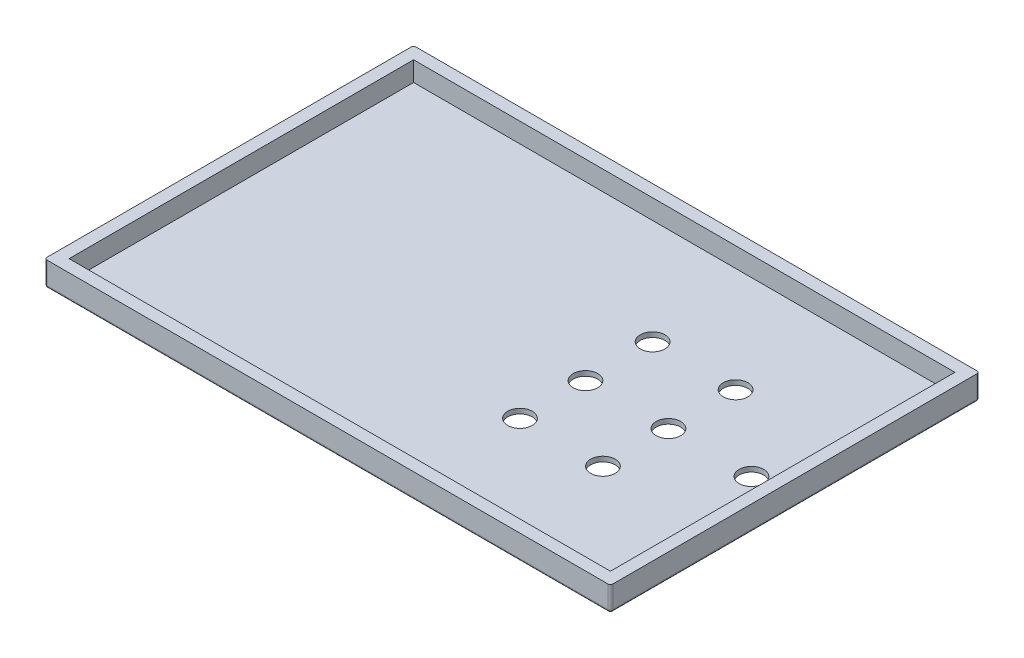
ISO-10303-21;
HEADER;
FILE_DESCRIPTION(('STEP AP214'),'2;1');
FILE_NAME('part.step','',(''),(''),'','','');
FILE_SCHEMA(('AUTOMOTIVE_DESIGN { 1 0 10303 214 1 1 1 1 }'));
ENDSEC;
DATA;
#1=APPLICATION_CONTEXT('core data for automotive mechanical design processes');
#2=APPLICATION_PROTOCOL_DEFINITION('international standard','automotive_design',2000,#1);
#3=PRODUCT_CONTEXT('',#1,'mechanical');
#4=PRODUCT('Part','Part','',(#3));
#5=PRODUCT_RELATED_PRODUCT_CATEGORY('part','',(#4));
#6=PRODUCT_DEFINITION_FORMATION('','',#4);
#7=PRODUCT_DEFINITION_CONTEXT('part definition',#1,'design');
#8=PRODUCT_DEFINITION('design','',#6,#7);
#9=PRODUCT_DEFINITION_SHAPE('','',#8);
#10=(LENGTH_UNIT() NAMED_UNIT(*) SI_UNIT(.MILLI.,.METRE.));
#11=(NAMED_UNIT(*) PLANE_ANGLE_UNIT() SI_UNIT($,.RADIAN.));
#12=(NAMED_UNIT(*) SI_UNIT($,.STERADIAN.) SOLID_ANGLE_UNIT());
#13=UNCERTAINTY_MEASURE_WITH_UNIT(LENGTH_MEASURE(1.E-05),#10,'distance_accuracy_value','');
#14=(GEOMETRIC_REPRESENTATION_CONTEXT(3) GLOBAL_UNCERTAINTY_ASSIGNED_CONTEXT((#13)) GLOBAL_UNIT_ASSIGNED_CONTEXT((#10,
#11,#12)) REPRESENTATION_CONTEXT('',''));
#15=CARTESIAN_POINT('',(0.,0.,0.));
#16=DIRECTION('',(0.,0.,1.));
#17=DIRECTION('',(1.,0.,0.));
#18=AXIS2_PLACEMENT_3D('',#15,#16,#17);
#19=CARTESIAN_POINT('',(0.,10.,0.));
#20=DIRECTION('',(1.,0.,0.));
#21=DIRECTION('',(0.,0.,-1.));
#22=AXIS2_PLACEMENT_3D('',#19,#20,#21);
#23=PLANE('',#22);
#24=DIRECTION('',(0.,-1.,0.));
#25=VECTOR('',#24,1.);
#26=CARTESIAN_POINT('',(0.,10.,-149.));
#27=LINE('',#26,#25);
#28=CARTESIAN_POINT('',(0.,10.,-149.));
#29=VERTEX_POINT('',#28);
#30=CARTESIAN_POINT('',(0.,1.,-149.));
#31=VERTEX_POINT('',#30);
#32=EDGE_CURVE('E208',#29,#31,#27,.T.);
#33=ORIENTED_EDGE('',*,*,#32,.T.);
#34=DIRECTION('',(0.,0.,1.));
#35=VECTOR('',#34,1.);
#36=CARTESIAN_POINT('',(0.,1.,-1.));
#37=LINE('',#36,#35);
#38=CARTESIAN_POINT('',(0.,1.,-1.));
#39=VERTEX_POINT('',#38);
#40=EDGE_CURVE('E247',#31,#39,#37,.T.);
#41=ORIENTED_EDGE('',*,*,#40,.T.);
#42=DIRECTION('',(0.,-1.,0.));
#43=VECTOR('',#42,1.);
#44=CARTESIAN_POINT('',(0.,10.,-1.));
#45=LINE('',#44,#43);
#46=CARTESIAN_POINT('',(0.,10.,-1.));
#47=VERTEX_POINT('',#46);
#48=EDGE_CURVE('E204',#39,#47,#45,.F.);
#49=ORIENTED_EDGE('',*,*,#48,.T.);
#50=DIRECTION('',(0.,0.,1.));
#51=VECTOR('',#50,1.);
#52=CARTESIAN_POINT('',(0.,10.,0.));
#53=LINE('',#52,#51);
#54=EDGE_CURVE('E186',#29,#47,#53,.T.);
#55=ORIENTED_EDGE('',*,*,#54,.F.);
#56=EDGE_LOOP('',(#33,#41,#49,#55));
#57=FACE_BOUND('',#56,.T.);
#58=ADVANCED_FACE('F41',(#57),#23,.F.);
#59=CARTESIAN_POINT('',(0.,10.,0.));
#60=DIRECTION('',(0.,0.,-1.));
#61=DIRECTION('',(-1.,0.,0.));
#62=AXIS2_PLACEMENT_3D('',#59,#60,#61);
#63=PLANE('',#62);
#64=DIRECTION('',(0.,-1.,0.));
#65=VECTOR('',#64,1.);
#66=CARTESIAN_POINT('',(1.,10.,0.));
#67=LINE('',#66,#65);
#68=CARTESIAN_POINT('',(1.,10.,0.));
#69=VERTEX_POINT('',#68);
#70=CARTESIAN_POINT('',(1.,1.,0.));
#71=VERTEX_POINT('',#70);
#72=EDGE_CURVE('E201',#69,#71,#67,.T.);
#73=ORIENTED_EDGE('',*,*,#72,.T.);
#74=DIRECTION('',(1.,0.,0.));
#75=VECTOR('',#74,1.);
#76=CARTESIAN_POINT('',(229.,1.,0.));
#77=LINE('',#76,#75);
#78=CARTESIAN_POINT('',(229.,1.,0.));
#79=VERTEX_POINT('',#78);
#80=EDGE_CURVE('E243',#71,#79,#77,.T.);
#81=ORIENTED_EDGE('',*,*,#80,.T.);
#82=DIRECTION('',(0.,-1.,0.));
#83=VECTOR('',#82,1.);
#84=CARTESIAN_POINT('',(229.,10.,0.));
#85=LINE('',#84,#83);
#86=CARTESIAN_POINT('',(229.,10.,0.));
#87=VERTEX_POINT('',#86);
#88=EDGE_CURVE('E225',#79,#87,#85,.F.);
#89=ORIENTED_EDGE('',*,*,#88,.T.);
#90=DIRECTION('',(1.,0.,0.));
#91=VECTOR('',#90,1.);
#92=CARTESIAN_POINT('',(0.,10.,0.));
#93=LINE('',#92,#91);
#94=EDGE_CURVE('E192',#69,#87,#93,.T.);
#95=ORIENTED_EDGE('',*,*,#94,.F.);
#96=EDGE_LOOP('',(#73,#81,#89,#95));
#97=FACE_BOUND('',#96,.T.);
#98=ADVANCED_FACE('F401',(#97),#63,.F.);
#99=CARTESIAN_POINT('',(230.,10.,0.));
#100=DIRECTION('',(-1.,0.,0.));
#101=DIRECTION('',(0.,0.,1.));
#102=AXIS2_PLACEMENT_3D('',#99,#100,#101);
#103=PLANE('',#102);
#104=DIRECTION('',(0.,-1.,0.));
#105=VECTOR('',#104,1.);
#106=CARTESIAN_POINT('',(230.,10.,-1.));
#107=LINE('',#106,#105);
#108=CARTESIAN_POINT('',(230.,10.,-1.));
#109=VERTEX_POINT('',#108);
#110=CARTESIAN_POINT('',(230.,1.,-1.));
#111=VERTEX_POINT('',#110);
#112=EDGE_CURVE('E222',#109,#111,#107,.T.);
#113=ORIENTED_EDGE('',*,*,#112,.T.);
#114=DIRECTION('',(0.,0.,-1.));
#115=VECTOR('',#114,1.);
#116=CARTESIAN_POINT('',(230.,1.,-149.));
#117=LINE('',#116,#115);
#118=CARTESIAN_POINT('',(230.,1.,-149.));
#119=VERTEX_POINT('',#118);
#120=EDGE_CURVE('E230',#111,#119,#117,.T.);
#121=ORIENTED_EDGE('',*,*,#120,.T.);
#122=DIRECTION('',(0.,-1.,0.));
#123=VECTOR('',#122,1.);
#124=CARTESIAN_POINT('',(230.,10.,-149.));
#125=LINE('',#124,#123);
#126=CARTESIAN_POINT('',(230.,10.,-149.));
#127=VERTEX_POINT('',#126);
#128=EDGE_CURVE('E220',#119,#127,#125,.F.);
#129=ORIENTED_EDGE('',*,*,#128,.T.);
#130=DIRECTION('',(0.,0.,-1.));
#131=VECTOR('',#130,1.);
#132=CARTESIAN_POINT('',(230.,10.,0.));
#133=LINE('',#132,#131);
#134=EDGE_CURVE('E195',#109,#127,#133,.T.);
#135=ORIENTED_EDGE('',*,*,#134,.F.);
#136=EDGE_LOOP('',(#113,#121,#129,#135));
#137=FACE_BOUND('',#136,.T.);
#138=ADVANCED_FACE('F406',(#137),#103,.F.);
#139=CARTESIAN_POINT('',(0.,10.,-150.));
#140=DIRECTION('',(0.,0.,1.));
#141=DIRECTION('',(1.,0.,0.));
#142=AXIS2_PLACEMENT_3D('',#139,#140,#141);
#143=PLANE('',#142);
#144=DIRECTION('',(0.,-1.,0.));
#145=VECTOR('',#144,1.);
#146=CARTESIAN_POINT('',(229.,10.,-150.));
#147=LINE('',#146,#145);
#148=CARTESIAN_POINT('',(229.,10.,-150.));
#149=VERTEX_POINT('',#148);
#150=CARTESIAN_POINT('',(229.,1.,-150.));
#151=VERTEX_POINT('',#150);
#152=EDGE_CURVE('E210',#149,#151,#147,.T.);
#153=ORIENTED_EDGE('',*,*,#152,.T.);
#154=DIRECTION('',(-1.,0.,0.));
#155=VECTOR('',#154,1.);
#156=CARTESIAN_POINT('',(1.,1.,-150.));
#157=LINE('',#156,#155);
#158=CARTESIAN_POINT('',(1.,1.,-150.));
#159=VERTEX_POINT('',#158);
#160=EDGE_CURVE('E11',#151,#159,#157,.T.);
#161=ORIENTED_EDGE('',*,*,#160,.T.);
#162=DIRECTION('',(0.,-1.,0.));
#163=VECTOR('',#162,1.);
#164=CARTESIAN_POINT('',(1.,10.,-150.));
#165=LINE('',#164,#163);
#166=CARTESIAN_POINT('',(1.,10.,-150.));
#167=VERTEX_POINT('',#166);
#168=EDGE_CURVE('E212',#159,#167,#165,.F.);
#169=ORIENTED_EDGE('',*,*,#168,.T.);
#170=DIRECTION('',(-1.,0.,0.));
#171=VECTOR('',#170,1.);
#172=CARTESIAN_POINT('',(0.,10.,-150.));
#173=LINE('',#172,#171);
#174=EDGE_CURVE('E198',#149,#167,#173,.T.);
#175=ORIENTED_EDGE('',*,*,#174,.F.);
#176=EDGE_LOOP('',(#153,#161,#169,#175));
#177=FACE_BOUND('',#176,.T.);
#178=ADVANCED_FACE('F374',(#177),#143,.F.);
#179=CARTESIAN_POINT('',(0.,10.,0.));
#180=DIRECTION('',(0.,-1.,0.));
#181=DIRECTION('',(0.,0.,-1.));
#182=AXIS2_PLACEMENT_3D('',#179,#180,#181);
#183=PLANE('',#182);
#184=DIRECTION('',(-1.,0.,0.));
#185=VECTOR('',#184,1.);
#186=CARTESIAN_POINT('',(4.98376453191582,10.,-145.011885739371));
#187=LINE('',#186,#185);
#188=CARTESIAN_POINT('',(225.016235468084,10.,-145.011885739371));
#189=VERTEX_POINT('',#188);
#190=CARTESIAN_POINT('',(4.98376453191582,10.,-145.011885739371));
#191=VERTEX_POINT('',#190);
#192=EDGE_CURVE('E179',#189,#191,#187,.T.);
#193=ORIENTED_EDGE('',*,*,#192,.F.);
#194=DIRECTION('',(0.,0.,-1.));
#195=VECTOR('',#194,1.);
#196=CARTESIAN_POINT('',(225.016235468084,10.,-145.011885739371));
#197=LINE('',#196,#195);
#198=CARTESIAN_POINT('',(225.016235468084,10.,-4.98811426062942));
#199=VERTEX_POINT('',#198);
#200=EDGE_CURVE('E150',#199,#189,#197,.T.);
#201=ORIENTED_EDGE('',*,*,#200,.F.);
#202=DIRECTION('',(1.,0.,0.));
#203=VECTOR('',#202,1.);
#204=CARTESIAN_POINT('',(4.98376453191582,10.,-4.98811426062942));
#205=LINE('',#204,#203);
#206=CARTESIAN_POINT('',(4.98376453191582,10.,-4.98811426062942));
#207=VERTEX_POINT('',#206);
#208=EDGE_CURVE('E167',#207,#199,#205,.T.);
#209=ORIENTED_EDGE('',*,*,#208,.F.);
#210=DIRECTION('',(0.,0.,1.));
#211=VECTOR('',#210,1.);
#212=CARTESIAN_POINT('',(4.98376453191582,10.,-145.011885739371));
#213=LINE('',#212,#211);
#214=EDGE_CURVE('E170',#191,#207,#213,.T.);
#215=ORIENTED_EDGE('',*,*,#214,.F.);
#216=EDGE_LOOP('',(#193,#201,#209,#215));
#217=FACE_BOUND('',#216,.T.);
#218=ORIENTED_EDGE('',*,*,#174,.T.);
#219=CARTESIAN_POINT('',(1.,10.,-149.));
#220=DIRECTION('',(0.,-1.,0.));
#221=DIRECTION('',(0.,0.,-1.));
#222=AXIS2_PLACEMENT_3D('',#219,#220,#221);
#223=CIRCLE('',#222,1.);
#224=EDGE_CURVE('E218',#167,#29,#223,.F.);
#225=ORIENTED_EDGE('',*,*,#224,.T.);
#226=ORIENTED_EDGE('',*,*,#54,.T.);
#227=CARTESIAN_POINT('',(1.,10.,-1.));
#228=DIRECTION('',(0.,-1.,0.));
#229=DIRECTION('',(0.,0.,-1.));
#230=AXIS2_PLACEMENT_3D('',#227,#228,#229);
#231=CIRCLE('',#230,1.);
#232=EDGE_CURVE('E206',#47,#69,#231,.F.);
#233=ORIENTED_EDGE('',*,*,#232,.T.);
#234=ORIENTED_EDGE('',*,*,#94,.T.);
#235=CARTESIAN_POINT('',(229.,10.,-1.));
#236=DIRECTION('',(0.,-1.,0.));
#237=DIRECTION('',(0.,0.,-1.));
#238=AXIS2_PLACEMENT_3D('',#235,#236,#237);
#239=CIRCLE('',#238,1.);
#240=EDGE_CURVE('E216',#87,#109,#239,.F.);
#241=ORIENTED_EDGE('',*,*,#240,.T.);
#242=ORIENTED_EDGE('',*,*,#134,.T.);
#243=CARTESIAN_POINT('',(229.,10.,-149.));
#244=DIRECTION('',(0.,-1.,0.));
#245=DIRECTION('',(0.,0.,-1.));
#246=AXIS2_PLACEMENT_3D('',#243,#244,#245);
#247=CIRCLE('',#246,1.);
#248=EDGE_CURVE('E214',#127,#149,#247,.F.);
#249=ORIENTED_EDGE('',*,*,#248,.T.);
#250=EDGE_LOOP('',(#218,#225,#226,#233,#234,#241,#242,#249));
#251=FACE_BOUND('',#250,.T.);
#252=ADVANCED_FACE('F341',(#217,#251),#183,.F.);
#253=CARTESIAN_POINT('',(0.,0.,0.));
#254=DIRECTION('',(0.,-1.,0.));
#255=DIRECTION('',(0.,0.,-1.));
#256=AXIS2_PLACEMENT_3D('',#253,#254,#255);
#257=PLANE('',#256);
#258=CARTESIAN_POINT('',(144.862491971459,0.,-102.290057641044));
#259=DIRECTION('',(0.,-1.,0.));
#260=DIRECTION('',(0.,0.,-1.));
#261=AXIS2_PLACEMENT_3D('',#258,#259,#260);
#262=CIRCLE('',#261,5.00000000000002);
#263=CARTESIAN_POINT('',(144.862491971459,0.,-107.290057641044));
#264=VERTEX_POINT('',#263);
#265=EDGE_CURVE('E334',#264,#264,#262,.T.);
#266=ORIENTED_EDGE('',*,*,#265,.F.);
#267=EDGE_LOOP('',(#266));
#268=FACE_BOUND('',#267,.T.);
#269=CARTESIAN_POINT('',(178.592552161168,0.,-102.290057641044));
#270=DIRECTION('',(0.,-1.,0.));
#271=DIRECTION('',(0.,0.,-1.));
#272=AXIS2_PLACEMENT_3D('',#269,#270,#271);
#273=CIRCLE('',#272,4.99999999999999);
#274=CARTESIAN_POINT('',(178.592552161168,0.,-107.290057641044));
#275=VERTEX_POINT('',#274);
#276=EDGE_CURVE('E332',#275,#275,#273,.T.);
#277=ORIENTED_EDGE('',*,*,#276,.F.);
#278=EDGE_LOOP('',(#277));
#279=FACE_BOUND('',#278,.T.);
#280=CARTESIAN_POINT('',(178.55656837104,0.,-48.4084667263639));
#281=DIRECTION('',(0.,-1.,0.));
#282=DIRECTION('',(0.,0.,-1.));
#283=AXIS2_PLACEMENT_3D('',#280,#281,#282);
#284=CIRCLE('',#283,4.99999999999999);
#285=CARTESIAN_POINT('',(178.55656837104,0.,-53.4084667263639));
#286=VERTEX_POINT('',#285);
#287=EDGE_CURVE('E319',#286,#286,#284,.T.);
#288=ORIENTED_EDGE('',*,*,#287,.F.);
#289=EDGE_LOOP('',(#288));
#290=FACE_BOUND('',#289,.T.);
#291=CARTESIAN_POINT('',(212.322612350877,0.,-75.));
#292=DIRECTION('',(0.,-1.,0.));
#293=DIRECTION('',(0.,0.,-1.));
#294=AXIS2_PLACEMENT_3D('',#291,#292,#293);
#295=CIRCLE('',#294,5.00000000000002);
#296=CARTESIAN_POINT('',(212.322612350877,0.,-80.));
#297=VERTEX_POINT('',#296);
#298=EDGE_CURVE('E321',#297,#297,#295,.T.);
#299=ORIENTED_EDGE('',*,*,#298,.F.);
#300=EDGE_LOOP('',(#299));
#301=FACE_BOUND('',#300,.T.);
#302=CARTESIAN_POINT('',(178.592552161168,0.,-75.));
#303=DIRECTION('',(0.,-1.,0.));
#304=DIRECTION('',(0.,0.,-1.));
#305=AXIS2_PLACEMENT_3D('',#302,#303,#304);
#306=CIRCLE('',#305,4.99999999999999);
#307=CARTESIAN_POINT('',(178.592552161168,0.,-80.));
#308=VERTEX_POINT('',#307);
#309=EDGE_CURVE('E326',#308,#308,#306,.T.);
#310=ORIENTED_EDGE('',*,*,#309,.F.);
#311=EDGE_LOOP('',(#310));
#312=FACE_BOUND('',#311,.T.);
#313=CARTESIAN_POINT('',(144.862491971459,0.,-75.));
#314=DIRECTION('',(0.,-1.,0.));
#315=DIRECTION('',(0.,0.,-1.));
#316=AXIS2_PLACEMENT_3D('',#313,#314,#315);
#317=CIRCLE('',#316,5.00000000000002);
#318=CARTESIAN_POINT('',(144.862491971459,0.,-80.));
#319=VERTEX_POINT('',#318);
#320=EDGE_CURVE('E329',#319,#319,#317,.T.);
#321=ORIENTED_EDGE('',*,*,#320,.F.);
#322=EDGE_LOOP('',(#321));
#323=FACE_BOUND('',#322,.T.);
#324=CARTESIAN_POINT('',(144.826508181331,0.,-48.4084667263639));
#325=DIRECTION('',(0.,-1.,0.));
#326=DIRECTION('',(0.,0.,-1.));
#327=AXIS2_PLACEMENT_3D('',#324,#325,#326);
#328=CIRCLE('',#327,5.00000000000002);
#329=CARTESIAN_POINT('',(144.826508181331,0.,-53.4084667263639));
#330=VERTEX_POINT('',#329);
#331=EDGE_CURVE('E173',#330,#330,#328,.T.);
#332=ORIENTED_EDGE('',*,*,#331,.F.);
#333=EDGE_LOOP('',(#332));
#334=FACE_BOUND('',#333,.T.);
#335=DIRECTION('',(-1.,0.,0.));
#336=VECTOR('',#335,1.);
#337=CARTESIAN_POINT('',(229.,0.,-149.));
#338=LINE('',#337,#336);
#339=CARTESIAN_POINT('',(1.,0.,-149.));
#340=VERTEX_POINT('',#339);
#341=CARTESIAN_POINT('',(229.,0.,-149.));
#342=VERTEX_POINT('',#341);
#343=EDGE_CURVE('E232',#340,#342,#338,.F.);
#344=ORIENTED_EDGE('',*,*,#343,.T.);
#345=DIRECTION('',(0.,0.,-1.));
#346=VECTOR('',#345,1.);
#347=CARTESIAN_POINT('',(229.,0.,-1.));
#348=LINE('',#347,#346);
#349=CARTESIAN_POINT('',(229.,0.,-1.));
#350=VERTEX_POINT('',#349);
#351=EDGE_CURVE('E238',#342,#350,#348,.F.);
#352=ORIENTED_EDGE('',*,*,#351,.T.);
#353=DIRECTION('',(1.,0.,0.));
#354=VECTOR('',#353,1.);
#355=CARTESIAN_POINT('',(1.,0.,-1.));
#356=LINE('',#355,#354);
#357=CARTESIAN_POINT('',(1.,0.,-1.));
#358=VERTEX_POINT('',#357);
#359=EDGE_CURVE('E236',#350,#358,#356,.F.);
#360=ORIENTED_EDGE('',*,*,#359,.T.);
#361=DIRECTION('',(0.,0.,1.));
#362=VECTOR('',#361,1.);
#363=CARTESIAN_POINT('',(1.,0.,-149.));
#364=LINE('',#363,#362);
#365=EDGE_CURVE('E234',#358,#340,#364,.F.);
#366=ORIENTED_EDGE('',*,*,#365,.T.);
#367=EDGE_LOOP('',(#344,#352,#360,#366));
#368=FACE_BOUND('',#367,.T.);
#369=ADVANCED_FACE('F338',(#268,#279,#290,#301,#312,#323,#334,#368),#257,.T.);
#370=CARTESIAN_POINT('',(225.016235468084,2.00000000000001,-145.011885739371));
#371=DIRECTION('',(1.,0.,0.));
#372=DIRECTION('',(0.,0.,-1.));
#373=AXIS2_PLACEMENT_3D('',#370,#371,#372);
#374=PLANE('',#373);
#375=ORIENTED_EDGE('',*,*,#200,.T.);
#376=DIRECTION('',(0.,1.,0.));
#377=VECTOR('',#376,1.);
#378=CARTESIAN_POINT('',(225.016235468084,2.00000000000001,-145.011885739371));
#379=LINE('',#378,#377);
#380=CARTESIAN_POINT('',(225.016235468084,2.00000000000001,-145.011885739371));
#381=VERTEX_POINT('',#380);
#382=EDGE_CURVE('E143',#381,#189,#379,.T.);
#383=ORIENTED_EDGE('',*,*,#382,.F.);
#384=DIRECTION('',(0.,0.,-1.));
#385=VECTOR('',#384,1.);
#386=CARTESIAN_POINT('',(225.016235468084,2.00000000000001,-145.011885739371));
#387=LINE('',#386,#385);
#388=CARTESIAN_POINT('',(225.016235468084,2.00000000000001,-4.98811426062942));
#389=VERTEX_POINT('',#388);
#390=EDGE_CURVE('E147',#389,#381,#387,.T.);
#391=ORIENTED_EDGE('',*,*,#390,.F.);
#392=DIRECTION('',(0.,1.,0.));
#393=VECTOR('',#392,1.);
#394=CARTESIAN_POINT('',(225.016235468084,2.00000000000001,-4.98811426062942));
#395=LINE('',#394,#393);
#396=EDGE_CURVE('E184',#389,#199,#395,.T.);
#397=ORIENTED_EDGE('',*,*,#396,.T.);
#398=EDGE_LOOP('',(#375,#383,#391,#397));
#399=FACE_BOUND('',#398,.T.);
#400=ADVANCED_FACE('F145',(#399),#374,.F.);
#401=CARTESIAN_POINT('',(4.98376453191582,2.00000000000001,-4.98811426062942));
#402=DIRECTION('',(0.,0.,1.));
#403=DIRECTION('',(1.,0.,0.));
#404=AXIS2_PLACEMENT_3D('',#401,#402,#403);
#405=PLANE('',#404);
#406=ORIENTED_EDGE('',*,*,#208,.T.);
#407=ORIENTED_EDGE('',*,*,#396,.F.);
#408=DIRECTION('',(1.,0.,0.));
#409=VECTOR('',#408,1.);
#410=CARTESIAN_POINT('',(4.98376453191582,2.00000000000001,-4.98811426062942));
#411=LINE('',#410,#409);
#412=CARTESIAN_POINT('',(4.98376453191582,2.00000000000001,-4.98811426062942));
#413=VERTEX_POINT('',#412);
#414=EDGE_CURVE('E155',#413,#389,#411,.T.);
#415=ORIENTED_EDGE('',*,*,#414,.F.);
#416=DIRECTION('',(0.,1.,0.));
#417=VECTOR('',#416,1.);
#418=CARTESIAN_POINT('',(4.98376453191582,2.00000000000001,-4.98811426062942));
#419=LINE('',#418,#417);
#420=EDGE_CURVE('E187',#413,#207,#419,.T.);
#421=ORIENTED_EDGE('',*,*,#420,.T.);
#422=EDGE_LOOP('',(#406,#407,#415,#421));
#423=FACE_BOUND('',#422,.T.);
#424=ADVANCED_FACE('F602',(#423),#405,.F.);
#425=CARTESIAN_POINT('',(4.98376453191582,2.00000000000001,-145.011885739371));
#426=DIRECTION('',(-1.,0.,0.));
#427=DIRECTION('',(0.,0.,1.));
#428=AXIS2_PLACEMENT_3D('',#425,#426,#427);
#429=PLANE('',#428);
#430=ORIENTED_EDGE('',*,*,#214,.T.);
#431=ORIENTED_EDGE('',*,*,#420,.F.);
#432=DIRECTION('',(0.,0.,1.));
#433=VECTOR('',#432,1.);
#434=CARTESIAN_POINT('',(4.98376453191582,2.00000000000001,-145.011885739371));
#435=LINE('',#434,#433);
#436=CARTESIAN_POINT('',(4.98376453191582,2.00000000000001,-145.011885739371));
#437=VERTEX_POINT('',#436);
#438=EDGE_CURVE('E163',#437,#413,#435,.T.);
#439=ORIENTED_EDGE('',*,*,#438,.F.);
#440=DIRECTION('',(0.,1.,0.));
#441=VECTOR('',#440,1.);
#442=CARTESIAN_POINT('',(4.98376453191582,2.00000000000001,-145.011885739371));
#443=LINE('',#442,#441);
#444=EDGE_CURVE('E154',#437,#191,#443,.T.);
#445=ORIENTED_EDGE('',*,*,#444,.T.);
#446=EDGE_LOOP('',(#430,#431,#439,#445));
#447=FACE_BOUND('',#446,.T.);
#448=ADVANCED_FACE('F592',(#447),#429,.F.);
#449=CARTESIAN_POINT('',(4.98376453191582,2.00000000000001,-145.011885739371));
#450=DIRECTION('',(0.,0.,-1.));
#451=DIRECTION('',(-1.,0.,0.));
#452=AXIS2_PLACEMENT_3D('',#449,#450,#451);
#453=PLANE('',#452);
#454=ORIENTED_EDGE('',*,*,#192,.T.);
#455=ORIENTED_EDGE('',*,*,#444,.F.);
#456=DIRECTION('',(-1.,0.,0.));
#457=VECTOR('',#456,1.);
#458=CARTESIAN_POINT('',(4.98376453191582,2.00000000000001,-145.011885739371));
#459=LINE('',#458,#457);
#460=EDGE_CURVE('E158',#381,#437,#459,.T.);
#461=ORIENTED_EDGE('',*,*,#460,.F.);
#462=ORIENTED_EDGE('',*,*,#382,.T.);
#463=EDGE_LOOP('',(#454,#455,#461,#462));
#464=FACE_BOUND('',#463,.T.);
#465=ADVANCED_FACE('F159',(#464),#453,.F.);
#466=CARTESIAN_POINT('',(0.,2.00000000000001,0.));
#467=DIRECTION('',(0.,1.,0.));
#468=DIRECTION('',(0.,0.,1.));
#469=AXIS2_PLACEMENT_3D('',#466,#467,#468);
#470=PLANE('',#469);
#471=CARTESIAN_POINT('',(144.862491971459,2.00000000000001,-102.290057641044));
#472=DIRECTION('',(0.,1.,0.));
#473=DIRECTION('',(0.,0.,1.));
#474=AXIS2_PLACEMENT_3D('',#471,#472,#473);
#475=CIRCLE('',#474,5.00000000000002);
#476=CARTESIAN_POINT('',(144.862491971459,2.00000000000001,-97.2900576410441));
#477=VERTEX_POINT('',#476);
#478=EDGE_CURVE('E45',#477,#477,#475,.T.);
#479=ORIENTED_EDGE('',*,*,#478,.F.);
#480=EDGE_LOOP('',(#479));
#481=FACE_BOUND('',#480,.T.);
#482=CARTESIAN_POINT('',(178.592552161168,2.00000000000001,-102.290057641044));
#483=DIRECTION('',(0.,1.,0.));
#484=DIRECTION('',(0.,0.,1.));
#485=AXIS2_PLACEMENT_3D('',#482,#483,#484);
#486=CIRCLE('',#485,4.99999999999999);
#487=CARTESIAN_POINT('',(178.592552161168,2.00000000000001,-97.2900576410442));
#488=VERTEX_POINT('',#487);
#489=EDGE_CURVE('E285',#488,#488,#486,.T.);
#490=ORIENTED_EDGE('',*,*,#489,.F.);
#491=EDGE_LOOP('',(#490));
#492=FACE_BOUND('',#491,.T.);
#493=CARTESIAN_POINT('',(178.55656837104,2.00000000000001,-48.4084667263639));
#494=DIRECTION('',(0.,1.,0.));
#495=DIRECTION('',(0.,0.,1.));
#496=AXIS2_PLACEMENT_3D('',#493,#494,#495);
#497=CIRCLE('',#496,4.99999999999999);
#498=CARTESIAN_POINT('',(178.55656837104,2.00000000000001,-43.4084667263639));
#499=VERTEX_POINT('',#498);
#500=EDGE_CURVE('E283',#499,#499,#497,.T.);
#501=ORIENTED_EDGE('',*,*,#500,.F.);
#502=EDGE_LOOP('',(#501));
#503=FACE_BOUND('',#502,.T.);
#504=CARTESIAN_POINT('',(212.322612350877,2.00000000000001,-75.));
#505=DIRECTION('',(0.,1.,0.));
#506=DIRECTION('',(0.,0.,1.));
#507=AXIS2_PLACEMENT_3D('',#504,#505,#506);
#508=CIRCLE('',#507,5.00000000000002);
#509=CARTESIAN_POINT('',(212.322612350877,2.00000000000001,-70.));
#510=VERTEX_POINT('',#509);
#511=EDGE_CURVE('E280',#510,#510,#508,.T.);
#512=ORIENTED_EDGE('',*,*,#511,.F.);
#513=EDGE_LOOP('',(#512));
#514=FACE_BOUND('',#513,.T.);
#515=CARTESIAN_POINT('',(178.592552161168,2.00000000000001,-75.));
#516=DIRECTION('',(0.,1.,0.));
#517=DIRECTION('',(0.,0.,1.));
#518=AXIS2_PLACEMENT_3D('',#515,#516,#517);
#519=CIRCLE('',#518,4.99999999999999);
#520=CARTESIAN_POINT('',(178.592552161168,2.00000000000001,-70.));
#521=VERTEX_POINT('',#520);
#522=EDGE_CURVE('E277',#521,#521,#519,.T.);
#523=ORIENTED_EDGE('',*,*,#522,.F.);
#524=EDGE_LOOP('',(#523));
#525=FACE_BOUND('',#524,.T.);
#526=CARTESIAN_POINT('',(144.862491971459,2.00000000000001,-75.));
#527=DIRECTION('',(0.,1.,0.));
#528=DIRECTION('',(0.,0.,1.));
#529=AXIS2_PLACEMENT_3D('',#526,#527,#528);
#530=CIRCLE('',#529,5.00000000000002);
#531=CARTESIAN_POINT('',(144.862491971459,2.00000000000001,-70.));
#532=VERTEX_POINT('',#531);
#533=EDGE_CURVE('E274',#532,#532,#530,.T.);
#534=ORIENTED_EDGE('',*,*,#533,.F.);
#535=EDGE_LOOP('',(#534));
#536=FACE_BOUND('',#535,.T.);
#537=CARTESIAN_POINT('',(144.826508181331,2.00000000000001,-48.4084667263639));
#538=DIRECTION('',(0.,1.,0.));
#539=DIRECTION('',(0.,0.,1.));
#540=AXIS2_PLACEMENT_3D('',#537,#538,#539);
#541=CIRCLE('',#540,5.00000000000002);
#542=CARTESIAN_POINT('',(144.826508181331,2.00000000000001,-43.4084667263638));
#543=VERTEX_POINT('',#542);
#544=EDGE_CURVE('E271',#543,#543,#541,.T.);
#545=ORIENTED_EDGE('',*,*,#544,.F.);
#546=EDGE_LOOP('',(#545));
#547=FACE_BOUND('',#546,.T.);
#548=ORIENTED_EDGE('',*,*,#390,.T.);
#549=ORIENTED_EDGE('',*,*,#460,.T.);
#550=ORIENTED_EDGE('',*,*,#438,.T.);
#551=ORIENTED_EDGE('',*,*,#414,.T.);
#552=EDGE_LOOP('',(#548,#549,#550,#551));
#553=FACE_BOUND('',#552,.T.);
#554=ADVANCED_FACE('F165',(#481,#492,#503,#514,#525,#536,#547,#553),#470,.T.);
#555=CARTESIAN_POINT('',(1.,10.,-1.));
#556=DIRECTION('',(0.,-1.,0.));
#557=DIRECTION('',(0.,0.,-1.));
#558=AXIS2_PLACEMENT_3D('',#555,#556,#557);
#559=CYLINDRICAL_SURFACE('',#558,1.);
#560=ORIENTED_EDGE('',*,*,#48,.F.);
#561=CARTESIAN_POINT('',(1.,1.,-1.));
#562=DIRECTION('',(0.,-1.,0.));
#563=DIRECTION('',(0.,0.,-1.));
#564=AXIS2_PLACEMENT_3D('',#561,#562,#563);
#565=CIRCLE('',#564,1.);
#566=EDGE_CURVE('E245',#39,#71,#565,.F.);
#567=ORIENTED_EDGE('',*,*,#566,.T.);
#568=ORIENTED_EDGE('',*,*,#72,.F.);
#569=ORIENTED_EDGE('',*,*,#232,.F.);
#570=EDGE_LOOP('',(#560,#567,#568,#569));
#571=FACE_BOUND('',#570,.T.);
#572=ADVANCED_FACE('F297',(#571),#559,.T.);
#573=CARTESIAN_POINT('',(1.,10.,-149.));
#574=DIRECTION('',(0.,-1.,0.));
#575=DIRECTION('',(0.,0.,-1.));
#576=AXIS2_PLACEMENT_3D('',#573,#574,#575);
#577=CYLINDRICAL_SURFACE('',#576,1.);
#578=ORIENTED_EDGE('',*,*,#168,.F.);
#579=CARTESIAN_POINT('',(1.,1.,-149.));
#580=DIRECTION('',(0.,-1.,0.));
#581=DIRECTION('',(0.,0.,-1.));
#582=AXIS2_PLACEMENT_3D('',#579,#580,#581);
#583=CIRCLE('',#582,1.);
#584=EDGE_CURVE('E50',#159,#31,#583,.F.);
#585=ORIENTED_EDGE('',*,*,#584,.T.);
#586=ORIENTED_EDGE('',*,*,#32,.F.);
#587=ORIENTED_EDGE('',*,*,#224,.F.);
#588=EDGE_LOOP('',(#578,#585,#586,#587));
#589=FACE_BOUND('',#588,.T.);
#590=ADVANCED_FACE('F378',(#589),#577,.T.);
#591=CARTESIAN_POINT('',(229.,10.,-1.));
#592=DIRECTION('',(0.,-1.,0.));
#593=DIRECTION('',(0.,0.,-1.));
#594=AXIS2_PLACEMENT_3D('',#591,#592,#593);
#595=CYLINDRICAL_SURFACE('',#594,1.);
#596=ORIENTED_EDGE('',*,*,#88,.F.);
#597=CARTESIAN_POINT('',(229.,1.,-1.));
#598=DIRECTION('',(0.,-1.,0.));
#599=DIRECTION('',(0.,0.,-1.));
#600=AXIS2_PLACEMENT_3D('',#597,#598,#599);
#601=CIRCLE('',#600,1.);
#602=EDGE_CURVE('E241',#79,#111,#601,.F.);
#603=ORIENTED_EDGE('',*,*,#602,.T.);
#604=ORIENTED_EDGE('',*,*,#112,.F.);
#605=ORIENTED_EDGE('',*,*,#240,.F.);
#606=EDGE_LOOP('',(#596,#603,#604,#605));
#607=FACE_BOUND('',#606,.T.);
#608=ADVANCED_FACE('F416',(#607),#595,.T.);
#609=CARTESIAN_POINT('',(229.,10.,-149.));
#610=DIRECTION('',(0.,-1.,0.));
#611=DIRECTION('',(0.,0.,-1.));
#612=AXIS2_PLACEMENT_3D('',#609,#610,#611);
#613=CYLINDRICAL_SURFACE('',#612,1.);
#614=ORIENTED_EDGE('',*,*,#128,.F.);
#615=CARTESIAN_POINT('',(229.,1.,-149.));
#616=DIRECTION('',(0.,-1.,0.));
#617=DIRECTION('',(0.,0.,-1.));
#618=AXIS2_PLACEMENT_3D('',#615,#616,#617);
#619=CIRCLE('',#618,1.);
#620=EDGE_CURVE('E227',#119,#151,#619,.F.);
#621=ORIENTED_EDGE('',*,*,#620,.T.);
#622=ORIENTED_EDGE('',*,*,#152,.F.);
#623=ORIENTED_EDGE('',*,*,#248,.F.);
#624=EDGE_LOOP('',(#614,#621,#622,#623));
#625=FACE_BOUND('',#624,.T.);
#626=ADVANCED_FACE('F371',(#625),#613,.T.);
#627=CARTESIAN_POINT('',(1.,1.,-1.));
#628=DIRECTION('',(0.,-1.,0.));
#629=DIRECTION('',(0.,0.,-1.));
#630=AXIS2_PLACEMENT_3D('',#627,#628,#629);
#631=SPHERICAL_SURFACE('',#630,1.);
#632=CARTESIAN_POINT('',(1.,1.,-1.));
#633=DIRECTION('',(1.,0.,0.));
#634=DIRECTION('',(0.,0.,-1.));
#635=AXIS2_PLACEMENT_3D('',#632,#633,#634);
#636=CIRCLE('',#635,1.);
#637=EDGE_CURVE('E266',#71,#358,#636,.T.);
#638=ORIENTED_EDGE('',*,*,#637,.F.);
#639=ORIENTED_EDGE('',*,*,#566,.F.);
#640=CARTESIAN_POINT('',(1.,1.,-1.));
#641=DIRECTION('',(0.,0.,-1.));
#642=DIRECTION('',(-1.,0.,0.));
#643=AXIS2_PLACEMENT_3D('',#640,#641,#642);
#644=CIRCLE('',#643,1.);
#645=EDGE_CURVE('E180',#358,#39,#644,.T.);
#646=ORIENTED_EDGE('',*,*,#645,.F.);
#647=EDGE_LOOP('',(#638,#639,#646));
#648=FACE_BOUND('',#647,.T.);
#649=ADVANCED_FACE('F43',(#648),#631,.T.);
#650=CARTESIAN_POINT('',(1.,1.,0.));
#651=DIRECTION('',(0.,0.,-1.));
#652=DIRECTION('',(-1.,0.,0.));
#653=AXIS2_PLACEMENT_3D('',#650,#651,#652);
#654=CYLINDRICAL_SURFACE('',#653,1.);
#655=ORIENTED_EDGE('',*,*,#645,.T.);
#656=ORIENTED_EDGE('',*,*,#40,.F.);
#657=CARTESIAN_POINT('',(1.,1.,-149.));
#658=DIRECTION('',(0.,0.,-1.));
#659=DIRECTION('',(-1.,0.,0.));
#660=AXIS2_PLACEMENT_3D('',#657,#658,#659);
#661=CIRCLE('',#660,1.);
#662=EDGE_CURVE('E263',#340,#31,#661,.T.);
#663=ORIENTED_EDGE('',*,*,#662,.F.);
#664=ORIENTED_EDGE('',*,*,#365,.F.);
#665=EDGE_LOOP('',(#655,#656,#663,#664));
#666=FACE_BOUND('',#665,.T.);
#667=ADVANCED_FACE('F383',(#666),#654,.T.);
#668=CARTESIAN_POINT('',(0.,1.,-1.));
#669=DIRECTION('',(-1.,0.,0.));
#670=DIRECTION('',(0.,0.,1.));
#671=AXIS2_PLACEMENT_3D('',#668,#669,#670);
#672=CYLINDRICAL_SURFACE('',#671,1.);
#673=ORIENTED_EDGE('',*,*,#637,.T.);
#674=ORIENTED_EDGE('',*,*,#359,.F.);
#675=CARTESIAN_POINT('',(229.,1.,-1.));
#676=DIRECTION('',(1.,0.,0.));
#677=DIRECTION('',(0.,0.,-1.));
#678=AXIS2_PLACEMENT_3D('',#675,#676,#677);
#679=CIRCLE('',#678,1.);
#680=EDGE_CURVE('E260',#79,#350,#679,.T.);
#681=ORIENTED_EDGE('',*,*,#680,.F.);
#682=ORIENTED_EDGE('',*,*,#80,.F.);
#683=EDGE_LOOP('',(#673,#674,#681,#682));
#684=FACE_BOUND('',#683,.T.);
#685=ADVANCED_FACE('F390',(#684),#672,.T.);
#686=CARTESIAN_POINT('',(1.,1.,-149.));
#687=DIRECTION('',(0.,-1.,0.));
#688=DIRECTION('',(0.,0.,-1.));
#689=AXIS2_PLACEMENT_3D('',#686,#687,#688);
#690=SPHERICAL_SURFACE('',#689,1.);
#691=ORIENTED_EDGE('',*,*,#662,.T.);
#692=ORIENTED_EDGE('',*,*,#584,.F.);
#693=CARTESIAN_POINT('',(1.,1.,-149.));
#694=DIRECTION('',(1.,0.,0.));
#695=DIRECTION('',(0.,0.,-1.));
#696=AXIS2_PLACEMENT_3D('',#693,#694,#695);
#697=CIRCLE('',#696,1.);
#698=EDGE_CURVE('E257',#340,#159,#697,.T.);
#699=ORIENTED_EDGE('',*,*,#698,.F.);
#700=EDGE_LOOP('',(#691,#692,#699));
#701=FACE_BOUND('',#700,.T.);
#702=ADVANCED_FACE('F387',(#701),#690,.T.);
#703=CARTESIAN_POINT('',(229.,1.,-1.));
#704=DIRECTION('',(0.,-1.,0.));
#705=DIRECTION('',(0.,0.,-1.));
#706=AXIS2_PLACEMENT_3D('',#703,#704,#705);
#707=SPHERICAL_SURFACE('',#706,1.);
#708=ORIENTED_EDGE('',*,*,#602,.F.);
#709=ORIENTED_EDGE('',*,*,#680,.T.);
#710=CARTESIAN_POINT('',(229.,1.,-1.));
#711=DIRECTION('',(0.,0.,-1.));
#712=DIRECTION('',(-1.,0.,0.));
#713=AXIS2_PLACEMENT_3D('',#710,#711,#712);
#714=CIRCLE('',#713,1.);
#715=EDGE_CURVE('E255',#111,#350,#714,.T.);
#716=ORIENTED_EDGE('',*,*,#715,.F.);
#717=EDGE_LOOP('',(#708,#709,#716));
#718=FACE_BOUND('',#717,.T.);
#719=ADVANCED_FACE('F389',(#718),#707,.T.);
#720=CARTESIAN_POINT('',(0.,1.,-149.));
#721=DIRECTION('',(1.,0.,0.));
#722=DIRECTION('',(0.,0.,-1.));
#723=AXIS2_PLACEMENT_3D('',#720,#721,#722);
#724=CYLINDRICAL_SURFACE('',#723,1.);
#725=ORIENTED_EDGE('',*,*,#698,.T.);
#726=ORIENTED_EDGE('',*,*,#160,.F.);
#727=CARTESIAN_POINT('',(229.,1.,-149.));
#728=DIRECTION('',(1.,0.,0.));
#729=DIRECTION('',(0.,0.,-1.));
#730=AXIS2_PLACEMENT_3D('',#727,#728,#729);
#731=CIRCLE('',#730,1.);
#732=EDGE_CURVE('E253',#342,#151,#731,.T.);
#733=ORIENTED_EDGE('',*,*,#732,.F.);
#734=ORIENTED_EDGE('',*,*,#343,.F.);
#735=EDGE_LOOP('',(#725,#726,#733,#734));
#736=FACE_BOUND('',#735,.T.);
#737=ADVANCED_FACE('F365',(#736),#724,.T.);
#738=CARTESIAN_POINT('',(229.,1.,0.));
#739=DIRECTION('',(0.,0.,1.));
#740=DIRECTION('',(1.,0.,0.));
#741=AXIS2_PLACEMENT_3D('',#738,#739,#740);
#742=CYLINDRICAL_SURFACE('',#741,1.);
#743=ORIENTED_EDGE('',*,*,#715,.T.);
#744=ORIENTED_EDGE('',*,*,#351,.F.);
#745=CARTESIAN_POINT('',(229.,1.,-149.));
#746=DIRECTION('',(0.,0.,-1.));
#747=DIRECTION('',(-1.,0.,0.));
#748=AXIS2_PLACEMENT_3D('',#745,#746,#747);
#749=CIRCLE('',#748,1.);
#750=EDGE_CURVE('E250',#119,#342,#749,.T.);
#751=ORIENTED_EDGE('',*,*,#750,.F.);
#752=ORIENTED_EDGE('',*,*,#120,.F.);
#753=EDGE_LOOP('',(#743,#744,#751,#752));
#754=FACE_BOUND('',#753,.T.);
#755=ADVANCED_FACE('F362',(#754),#742,.T.);
#756=CARTESIAN_POINT('',(229.,1.,-149.));
#757=DIRECTION('',(0.,-1.,0.));
#758=DIRECTION('',(0.,0.,-1.));
#759=AXIS2_PLACEMENT_3D('',#756,#757,#758);
#760=SPHERICAL_SURFACE('',#759,1.);
#761=ORIENTED_EDGE('',*,*,#732,.T.);
#762=ORIENTED_EDGE('',*,*,#620,.F.);
#763=ORIENTED_EDGE('',*,*,#750,.T.);
#764=EDGE_LOOP('',(#761,#762,#763));
#765=FACE_BOUND('',#764,.T.);
#766=ADVANCED_FACE('F314',(#765),#760,.T.);
#767=CARTESIAN_POINT('',(144.826508181331,10.,-48.4084667263639));
#768=DIRECTION('',(0.,-1.,0.));
#769=DIRECTION('',(0.,0.,-1.));
#770=AXIS2_PLACEMENT_3D('',#767,#768,#769);
#771=CYLINDRICAL_SURFACE('',#770,5.00000000000002);
#772=ORIENTED_EDGE('',*,*,#544,.T.);
#773=EDGE_LOOP('',(#772));
#774=FACE_BOUND('',#773,.T.);
#775=ORIENTED_EDGE('',*,*,#331,.T.);
#776=EDGE_LOOP('',(#775));
#777=FACE_BOUND('',#776,.T.);
#778=ADVANCED_FACE('F310',(#774,#777),#771,.F.);
#779=CARTESIAN_POINT('',(144.862491971459,10.,-75.));
#780=DIRECTION('',(0.,-1.,0.));
#781=DIRECTION('',(0.,0.,-1.));
#782=AXIS2_PLACEMENT_3D('',#779,#780,#781);
#783=CYLINDRICAL_SURFACE('',#782,5.00000000000002);
#784=ORIENTED_EDGE('',*,*,#533,.T.);
#785=EDGE_LOOP('',(#784));
#786=FACE_BOUND('',#785,.T.);
#787=ORIENTED_EDGE('',*,*,#320,.T.);
#788=EDGE_LOOP('',(#787));
#789=FACE_BOUND('',#788,.T.);
#790=ADVANCED_FACE('F313',(#786,#789),#783,.F.);
#791=CARTESIAN_POINT('',(178.592552161168,10.,-75.));
#792=DIRECTION('',(0.,-1.,0.));
#793=DIRECTION('',(0.,0.,-1.));
#794=AXIS2_PLACEMENT_3D('',#791,#792,#793);
#795=CYLINDRICAL_SURFACE('',#794,4.99999999999999);
#796=ORIENTED_EDGE('',*,*,#522,.T.);
#797=EDGE_LOOP('',(#796));
#798=FACE_BOUND('',#797,.T.);
#799=ORIENTED_EDGE('',*,*,#309,.T.);
#800=EDGE_LOOP('',(#799));
#801=FACE_BOUND('',#800,.T.);
#802=ADVANCED_FACE('F452',(#798,#801),#795,.F.);
#803=CARTESIAN_POINT('',(212.322612350877,10.,-75.));
#804=DIRECTION('',(0.,-1.,0.));
#805=DIRECTION('',(0.,0.,-1.));
#806=AXIS2_PLACEMENT_3D('',#803,#804,#805);
#807=CYLINDRICAL_SURFACE('',#806,5.00000000000002);
#808=ORIENTED_EDGE('',*,*,#511,.T.);
#809=EDGE_LOOP('',(#808));
#810=FACE_BOUND('',#809,.T.);
#811=ORIENTED_EDGE('',*,*,#298,.T.);
#812=EDGE_LOOP('',(#811));
#813=FACE_BOUND('',#812,.T.);
#814=ADVANCED_FACE('F460',(#810,#813),#807,.F.);
#815=CARTESIAN_POINT('',(178.55656837104,10.,-48.4084667263639));
#816=DIRECTION('',(0.,-1.,0.));
#817=DIRECTION('',(0.,0.,-1.));
#818=AXIS2_PLACEMENT_3D('',#815,#816,#817);
#819=CYLINDRICAL_SURFACE('',#818,4.99999999999999);
#820=ORIENTED_EDGE('',*,*,#500,.T.);
#821=EDGE_LOOP('',(#820));
#822=FACE_BOUND('',#821,.T.);
#823=ORIENTED_EDGE('',*,*,#287,.T.);
#824=EDGE_LOOP('',(#823));
#825=FACE_BOUND('',#824,.T.);
#826=ADVANCED_FACE('F468',(#822,#825),#819,.F.);
#827=CARTESIAN_POINT('',(178.592552161168,10.,-102.290057641044));
#828=DIRECTION('',(0.,-1.,0.));
#829=DIRECTION('',(0.,0.,-1.));
#830=AXIS2_PLACEMENT_3D('',#827,#828,#829);
#831=CYLINDRICAL_SURFACE('',#830,4.99999999999999);
#832=ORIENTED_EDGE('',*,*,#489,.T.);
#833=EDGE_LOOP('',(#832));
#834=FACE_BOUND('',#833,.T.);
#835=ORIENTED_EDGE('',*,*,#276,.T.);
#836=EDGE_LOOP('',(#835));
#837=FACE_BOUND('',#836,.T.);
#838=ADVANCED_FACE('F476',(#834,#837),#831,.F.);
#839=CARTESIAN_POINT('',(144.862491971459,10.,-102.290057641044));
#840=DIRECTION('',(0.,-1.,0.));
#841=DIRECTION('',(0.,0.,-1.));
#842=AXIS2_PLACEMENT_3D('',#839,#840,#841);
#843=CYLINDRICAL_SURFACE('',#842,5.00000000000002);
#844=ORIENTED_EDGE('',*,*,#478,.T.);
#845=EDGE_LOOP('',(#844));
#846=FACE_BOUND('',#845,.T.);
#847=ORIENTED_EDGE('',*,*,#265,.T.);
#848=EDGE_LOOP('',(#847));
#849=FACE_BOUND('',#848,.T.);
#850=ADVANCED_FACE('F292',(#846,#849),#843,.F.);
#851=CLOSED_SHELL('',(#58,#98,#138,#178,#252,#369,#400,#424,#448,#465,#554,#572,#590,#608,#626,
#649,#667,#685,#702,#719,#737,#755,#766,#778,#790,#802,#814,#826,#838,#850));
#852=MANIFOLD_SOLID_BREP('B2',#851);
#853=ADVANCED_BREP_SHAPE_REPRESENTATION('',(#18,#852),#14);
#854=SHAPE_DEFINITION_REPRESENTATION(#9,#853);
ENDSEC;
END-ISO-10303-21;
